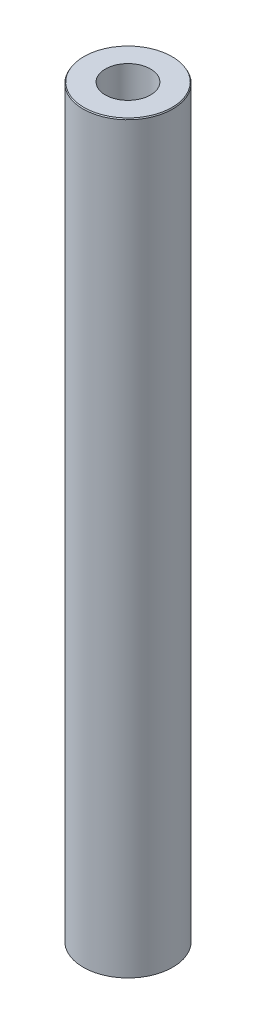
ISO-10303-21;
HEADER;
FILE_DESCRIPTION(('STEP AP214'),'2;1');
FILE_NAME('part.step','',(''),(''),'','','');
FILE_SCHEMA(('AUTOMOTIVE_DESIGN { 1 0 10303 214 1 1 1 1 }'));
ENDSEC;
DATA;
#1=APPLICATION_CONTEXT('core data for automotive mechanical design processes');
#2=APPLICATION_PROTOCOL_DEFINITION('international standard','automotive_design',2000,#1);
#3=PRODUCT_CONTEXT('',#1,'mechanical');
#4=PRODUCT('Part','Part','',(#3));
#5=PRODUCT_RELATED_PRODUCT_CATEGORY('part','',(#4));
#6=PRODUCT_DEFINITION_FORMATION('','',#4);
#7=PRODUCT_DEFINITION_CONTEXT('part definition',#1,'design');
#8=PRODUCT_DEFINITION('design','',#6,#7);
#9=PRODUCT_DEFINITION_SHAPE('','',#8);
#10=(LENGTH_UNIT() NAMED_UNIT(*) SI_UNIT(.MILLI.,.METRE.));
#11=(NAMED_UNIT(*) PLANE_ANGLE_UNIT() SI_UNIT($,.RADIAN.));
#12=(NAMED_UNIT(*) SI_UNIT($,.STERADIAN.) SOLID_ANGLE_UNIT());
#13=UNCERTAINTY_MEASURE_WITH_UNIT(LENGTH_MEASURE(1.E-05),#10,'distance_accuracy_value','');
#14=(GEOMETRIC_REPRESENTATION_CONTEXT(3) GLOBAL_UNCERTAINTY_ASSIGNED_CONTEXT((#13)) GLOBAL_UNIT_ASSIGNED_CONTEXT((#10,
#11,#12)) REPRESENTATION_CONTEXT('',''));
#15=CARTESIAN_POINT('',(0.,0.,0.));
#16=DIRECTION('',(0.,0.,1.));
#17=DIRECTION('',(1.,0.,0.));
#18=AXIS2_PLACEMENT_3D('',#15,#16,#17);
#19=CARTESIAN_POINT('',(0.,208.268692321926,0.));
#20=DIRECTION('',(0.,-1.,0.));
#21=DIRECTION('',(0.,0.,-1.));
#22=AXIS2_PLACEMENT_3D('',#19,#20,#21);
#23=CYLINDRICAL_SURFACE('',#22,12.5);
#24=CARTESIAN_POINT('',(0.,207.950293851946,0.));
#25=DIRECTION('',(0.,1.,0.));
#26=DIRECTION('',(0.,0.,1.));
#27=AXIS2_PLACEMENT_3D('',#24,#25,#26);
#28=CIRCLE('',#27,12.5);
#29=CARTESIAN_POINT('',(0.,207.950293851946,12.5));
#30=VERTEX_POINT('',#29);
#31=EDGE_CURVE('E50',#30,#30,#28,.F.);
#32=ORIENTED_EDGE('',*,*,#31,.T.);
#33=EDGE_LOOP('',(#32));
#34=FACE_BOUND('',#33,.T.);
#35=CARTESIAN_POINT('',(0.,0.183827442352763,0.));
#36=DIRECTION('',(0.,1.,0.));
#37=DIRECTION('',(0.,0.,1.));
#38=AXIS2_PLACEMENT_3D('',#35,#36,#37);
#39=CIRCLE('',#38,12.5);
#40=CARTESIAN_POINT('',(0.,0.183827442352763,12.5));
#41=VERTEX_POINT('',#40);
#42=EDGE_CURVE('E51',#41,#41,#39,.T.);
#43=ORIENTED_EDGE('',*,*,#42,.T.);
#44=EDGE_LOOP('',(#43));
#45=FACE_BOUND('',#44,.T.);
#46=ADVANCED_FACE('F39',(#34,#45),#23,.T.);
#47=CARTESIAN_POINT('',(0.,208.268692321926,0.));
#48=DIRECTION('',(0.,1.,0.));
#49=DIRECTION('',(0.,0.,1.));
#50=AXIS2_PLACEMENT_3D('',#47,#48,#49);
#51=PLANE('',#50);
#52=CARTESIAN_POINT('',(0.,208.268692321926,0.));
#53=DIRECTION('',(0.,1.,0.));
#54=DIRECTION('',(0.,0.,1.));
#55=AXIS2_PLACEMENT_3D('',#52,#53,#54);
#56=CIRCLE('',#55,12.3161725576473);
#57=CARTESIAN_POINT('',(0.,208.268692321926,12.3161725576473));
#58=VERTEX_POINT('',#57);
#59=EDGE_CURVE('E54',#58,#58,#56,.T.);
#60=ORIENTED_EDGE('',*,*,#59,.T.);
#61=EDGE_LOOP('',(#60));
#62=FACE_BOUND('',#61,.T.);
#63=CARTESIAN_POINT('',(0.,208.268692321926,0.));
#64=DIRECTION('',(0.,1.,0.));
#65=DIRECTION('',(0.,0.,1.));
#66=AXIS2_PLACEMENT_3D('',#63,#64,#65);
#67=CIRCLE('',#66,6.30944571947311);
#68=CARTESIAN_POINT('',(0.,208.268692321926,6.30944571947311));
#69=VERTEX_POINT('',#68);
#70=EDGE_CURVE('E58',#69,#69,#67,.T.);
#71=ORIENTED_EDGE('',*,*,#70,.F.);
#72=EDGE_LOOP('',(#71));
#73=FACE_BOUND('',#72,.T.);
#74=ADVANCED_FACE('F69',(#62,#73),#51,.T.);
#75=CARTESIAN_POINT('',(0.,0.,0.));
#76=DIRECTION('',(0.,1.,0.));
#77=DIRECTION('',(0.,0.,1.));
#78=AXIS2_PLACEMENT_3D('',#75,#76,#77);
#79=PLANE('',#78);
#80=CARTESIAN_POINT('',(0.,0.,0.));
#81=DIRECTION('',(0.,1.,0.));
#82=DIRECTION('',(0.,0.,1.));
#83=AXIS2_PLACEMENT_3D('',#80,#81,#82);
#84=CIRCLE('',#83,12.1816015300195);
#85=CARTESIAN_POINT('',(0.,0.,12.1816015300195));
#86=VERTEX_POINT('',#85);
#87=EDGE_CURVE('E10',#86,#86,#84,.F.);
#88=ORIENTED_EDGE('',*,*,#87,.T.);
#89=EDGE_LOOP('',(#88));
#90=FACE_BOUND('',#89,.T.);
#91=CARTESIAN_POINT('',(0.,0.,0.));
#92=DIRECTION('',(0.,1.,0.));
#93=DIRECTION('',(0.,0.,1.));
#94=AXIS2_PLACEMENT_3D('',#91,#92,#93);
#95=CIRCLE('',#94,6.30944571947311);
#96=CARTESIAN_POINT('',(0.,0.,6.30944571947311));
#97=VERTEX_POINT('',#96);
#98=EDGE_CURVE('E63',#97,#97,#95,.T.);
#99=ORIENTED_EDGE('',*,*,#98,.T.);
#100=EDGE_LOOP('',(#99));
#101=FACE_BOUND('',#100,.T.);
#102=ADVANCED_FACE('F75',(#90,#101),#79,.F.);
#103=CARTESIAN_POINT('',(0.,208.268692321926,0.));
#104=DIRECTION('',(0.,-1.,0.));
#105=DIRECTION('',(0.,0.,-1.));
#106=AXIS2_PLACEMENT_3D('',#103,#104,#105);
#107=CYLINDRICAL_SURFACE('',#106,6.30944571947311);
#108=ORIENTED_EDGE('',*,*,#70,.T.);
#109=EDGE_LOOP('',(#108));
#110=FACE_BOUND('',#109,.T.);
#111=ORIENTED_EDGE('',*,*,#98,.F.);
#112=EDGE_LOOP('',(#111));
#113=FACE_BOUND('',#112,.T.);
#114=ADVANCED_FACE('F70',(#110,#113),#107,.F.);
#115=CARTESIAN_POINT('',(0.,208.268692321926,0.));
#116=DIRECTION('',(0.,-1.,0.));
#117=DIRECTION('',(0.,0.,-1.));
#118=AXIS2_PLACEMENT_3D('',#115,#116,#117);
#119=CONICAL_SURFACE('',#118,12.3161725576473,0.523598775598257);
#120=ORIENTED_EDGE('',*,*,#31,.F.);
#121=EDGE_LOOP('',(#120));
#122=FACE_BOUND('',#121,.T.);
#123=ORIENTED_EDGE('',*,*,#59,.F.);
#124=EDGE_LOOP('',(#123));
#125=FACE_BOUND('',#124,.T.);
#126=ADVANCED_FACE('F81',(#122,#125),#119,.T.);
#127=CARTESIAN_POINT('',(0.,0.183827442352763,0.));
#128=DIRECTION('',(0.,1.,0.));
#129=DIRECTION('',(0.,0.,1.));
#130=AXIS2_PLACEMENT_3D('',#127,#128,#129);
#131=CONICAL_SURFACE('',#130,12.5,1.04719755119664);
#132=ORIENTED_EDGE('',*,*,#87,.F.);
#133=EDGE_LOOP('',(#132));
#134=FACE_BOUND('',#133,.T.);
#135=ORIENTED_EDGE('',*,*,#42,.F.);
#136=EDGE_LOOP('',(#135));
#137=FACE_BOUND('',#136,.T.);
#138=ADVANCED_FACE('F45',(#134,#137),#131,.T.);
#139=CLOSED_SHELL('',(#46,#74,#102,#114,#126,#138));
#140=MANIFOLD_SOLID_BREP('B2',#139);
#141=ADVANCED_BREP_SHAPE_REPRESENTATION('',(#18,#140),#14);
#142=SHAPE_DEFINITION_REPRESENTATION(#9,#141);
ENDSEC;
END-ISO-10303-21;
